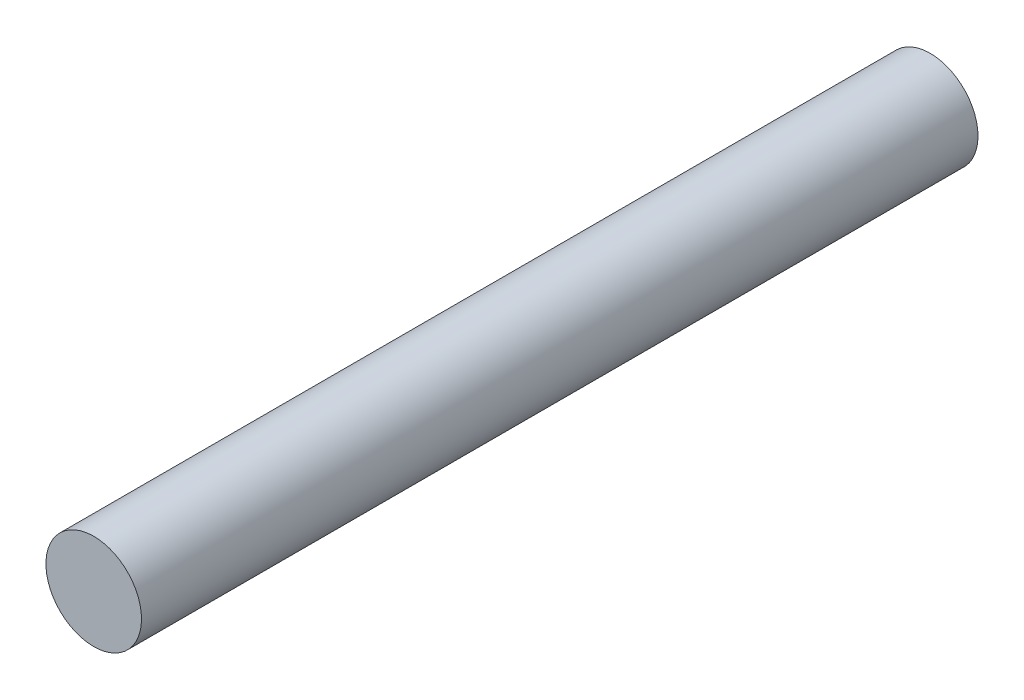
ISO-10303-21;
HEADER;
FILE_DESCRIPTION(('STEP AP214'),'2;1');
FILE_NAME('part.step','',(''),(''),'','','');
FILE_SCHEMA(('AUTOMOTIVE_DESIGN { 1 0 10303 214 1 1 1 1 }'));
ENDSEC;
DATA;
#1=APPLICATION_CONTEXT('core data for automotive mechanical design processes');
#2=APPLICATION_PROTOCOL_DEFINITION('international standard','automotive_design',2000,#1);
#3=PRODUCT_CONTEXT('',#1,'mechanical');
#4=PRODUCT('Part','Part','',(#3));
#5=PRODUCT_RELATED_PRODUCT_CATEGORY('part','',(#4));
#6=PRODUCT_DEFINITION_FORMATION('','',#4);
#7=PRODUCT_DEFINITION_CONTEXT('part definition',#1,'design');
#8=PRODUCT_DEFINITION('design','',#6,#7);
#9=PRODUCT_DEFINITION_SHAPE('','',#8);
#10=(LENGTH_UNIT() NAMED_UNIT(*) SI_UNIT(.MILLI.,.METRE.));
#11=(NAMED_UNIT(*) PLANE_ANGLE_UNIT() SI_UNIT($,.RADIAN.));
#12=(NAMED_UNIT(*) SI_UNIT($,.STERADIAN.) SOLID_ANGLE_UNIT());
#13=UNCERTAINTY_MEASURE_WITH_UNIT(LENGTH_MEASURE(1.E-05),#10,'distance_accuracy_value','');
#14=(GEOMETRIC_REPRESENTATION_CONTEXT(3) GLOBAL_UNCERTAINTY_ASSIGNED_CONTEXT((#13)) GLOBAL_UNIT_ASSIGNED_CONTEXT((#10,
#11,#12)) REPRESENTATION_CONTEXT('',''));
#15=CARTESIAN_POINT('',(0.,0.,0.));
#16=DIRECTION('',(0.,0.,1.));
#17=DIRECTION('',(1.,0.,0.));
#18=AXIS2_PLACEMENT_3D('',#15,#16,#17);
#19=CARTESIAN_POINT('',(0.,0.,70.));
#20=DIRECTION('',(0.,0.,-1.));
#21=DIRECTION('',(-1.,0.,0.));
#22=AXIS2_PLACEMENT_3D('',#19,#20,#21);
#23=CYLINDRICAL_SURFACE('',#22,4.);
#24=CARTESIAN_POINT('',(0.,0.,70.));
#25=DIRECTION('',(0.,0.,1.));
#26=DIRECTION('',(1.,0.,0.));
#27=AXIS2_PLACEMENT_3D('',#24,#25,#26);
#28=CIRCLE('',#27,4.);
#29=CARTESIAN_POINT('',(4.,0.,70.));
#30=VERTEX_POINT('',#29);
#31=EDGE_CURVE('E10',#30,#30,#28,.T.);
#32=ORIENTED_EDGE('',*,*,#31,.F.);
#33=EDGE_LOOP('',(#32));
#34=FACE_BOUND('',#33,.T.);
#35=CARTESIAN_POINT('',(0.,0.,0.));
#36=DIRECTION('',(0.,0.,1.));
#37=DIRECTION('',(1.,0.,0.));
#38=AXIS2_PLACEMENT_3D('',#35,#36,#37);
#39=CIRCLE('',#38,4.);
#40=CARTESIAN_POINT('',(4.,0.,0.));
#41=VERTEX_POINT('',#40);
#42=EDGE_CURVE('E36',#41,#41,#39,.T.);
#43=ORIENTED_EDGE('',*,*,#42,.T.);
#44=EDGE_LOOP('',(#43));
#45=FACE_BOUND('',#44,.T.);
#46=ADVANCED_FACE('F33',(#34,#45),#23,.T.);
#47=CARTESIAN_POINT('',(0.,0.,70.));
#48=DIRECTION('',(0.,0.,1.));
#49=DIRECTION('',(1.,0.,0.));
#50=AXIS2_PLACEMENT_3D('',#47,#48,#49);
#51=PLANE('',#50);
#52=ORIENTED_EDGE('',*,*,#31,.T.);
#53=EDGE_LOOP('',(#52));
#54=FACE_BOUND('',#53,.T.);
#55=ADVANCED_FACE('F48',(#54),#51,.T.);
#56=CARTESIAN_POINT('',(0.,0.,0.));
#57=DIRECTION('',(0.,0.,1.));
#58=DIRECTION('',(1.,0.,0.));
#59=AXIS2_PLACEMENT_3D('',#56,#57,#58);
#60=PLANE('',#59);
#61=ORIENTED_EDGE('',*,*,#42,.F.);
#62=EDGE_LOOP('',(#61));
#63=FACE_BOUND('',#62,.T.);
#64=ADVANCED_FACE('F46',(#63),#60,.F.);
#65=CLOSED_SHELL('',(#46,#55,#64));
#66=MANIFOLD_SOLID_BREP('B2',#65);
#67=ADVANCED_BREP_SHAPE_REPRESENTATION('',(#18,#66),#14);
#68=SHAPE_DEFINITION_REPRESENTATION(#9,#67);
ENDSEC;
END-ISO-10303-21;
